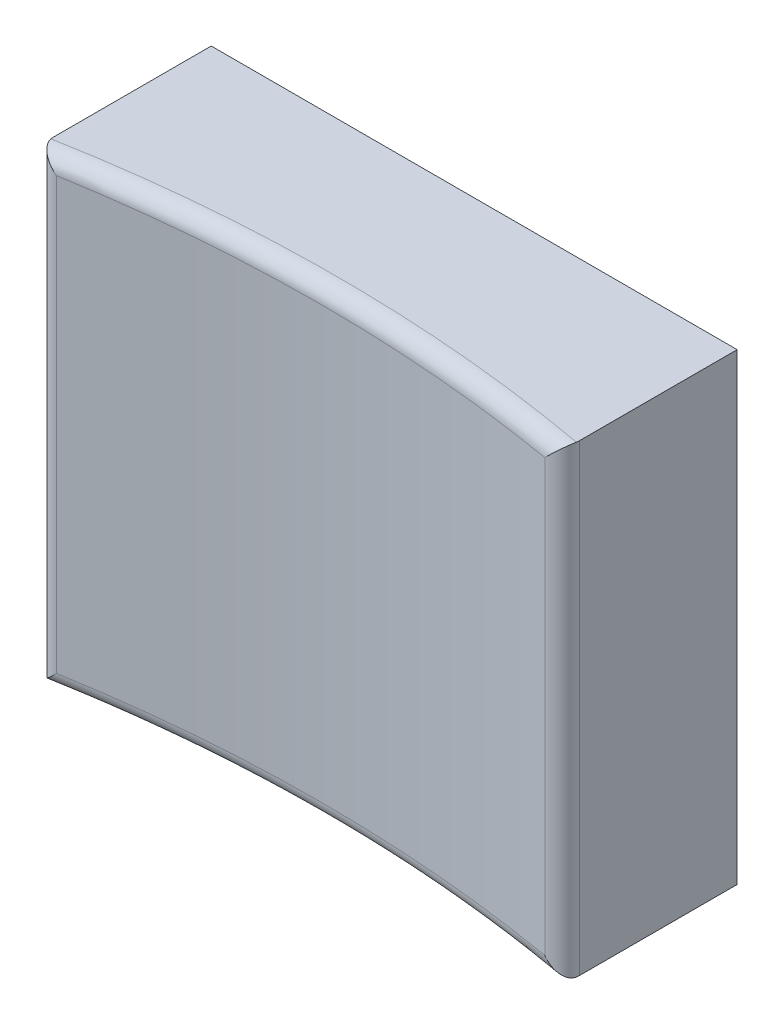
ISO-10303-21;
HEADER;
FILE_DESCRIPTION(('STEP AP214'),'2;1');
FILE_NAME('part.step','',(''),(''),'','','');
FILE_SCHEMA(('AUTOMOTIVE_DESIGN { 1 0 10303 214 1 1 1 1 }'));
ENDSEC;
DATA;
#1=APPLICATION_CONTEXT('core data for automotive mechanical design processes');
#2=APPLICATION_PROTOCOL_DEFINITION('international standard','automotive_design',2000,#1);
#3=PRODUCT_CONTEXT('',#1,'mechanical');
#4=PRODUCT('Part','Part','',(#3));
#5=PRODUCT_RELATED_PRODUCT_CATEGORY('part','',(#4));
#6=PRODUCT_DEFINITION_FORMATION('','',#4);
#7=PRODUCT_DEFINITION_CONTEXT('part definition',#1,'design');
#8=PRODUCT_DEFINITION('design','',#6,#7);
#9=PRODUCT_DEFINITION_SHAPE('','',#8);
#10=(LENGTH_UNIT() NAMED_UNIT(*) SI_UNIT(.MILLI.,.METRE.));
#11=(NAMED_UNIT(*) PLANE_ANGLE_UNIT() SI_UNIT($,.RADIAN.));
#12=(NAMED_UNIT(*) SI_UNIT($,.STERADIAN.) SOLID_ANGLE_UNIT());
#13=UNCERTAINTY_MEASURE_WITH_UNIT(LENGTH_MEASURE(1.E-05),#10,'distance_accuracy_value','');
#14=(GEOMETRIC_REPRESENTATION_CONTEXT(3) GLOBAL_UNCERTAINTY_ASSIGNED_CONTEXT((#13)) GLOBAL_UNIT_ASSIGNED_CONTEXT((#10,
#11,#12)) REPRESENTATION_CONTEXT('',''));
#15=CARTESIAN_POINT('',(0.,0.,0.));
#16=DIRECTION('',(0.,0.,1.));
#17=DIRECTION('',(1.,0.,0.));
#18=AXIS2_PLACEMENT_3D('',#15,#16,#17);
#19=CARTESIAN_POINT('',(-4.1529,3.6576,2.794));
#20=DIRECTION('',(1.,0.,0.));
#21=DIRECTION('',(0.,0.,-1.));
#22=AXIS2_PLACEMENT_3D('',#19,#20,#21);
#23=PLANE('',#22);
#24=DIRECTION('',(0.,0.,-1.));
#25=VECTOR('',#24,1.);
#26=CARTESIAN_POINT('',(-4.1529,-3.6576,2.794));
#27=LINE('',#26,#25);
#28=CARTESIAN_POINT('',(-4.1529,-3.6576,2.49082226780297));
#29=VERTEX_POINT('',#28);
#30=CARTESIAN_POINT('',(-4.1529,-3.6576,0.));
#31=VERTEX_POINT('',#30);
#32=EDGE_CURVE('E100',#29,#31,#27,.T.);
#33=ORIENTED_EDGE('',*,*,#32,.F.);
#34=DIRECTION('',(0.,-1.,0.));
#35=VECTOR('',#34,1.);
#36=CARTESIAN_POINT('',(-4.1529,3.6576,2.49082226780297));
#37=LINE('',#36,#35);
#38=CARTESIAN_POINT('',(-4.1529,3.6576,2.49082226780297));
#39=VERTEX_POINT('',#38);
#40=EDGE_CURVE('E11',#29,#39,#37,.F.);
#41=ORIENTED_EDGE('',*,*,#40,.T.);
#42=DIRECTION('',(0.,0.,-1.));
#43=VECTOR('',#42,1.);
#44=CARTESIAN_POINT('',(-4.1529,3.6576,2.794));
#45=LINE('',#44,#43);
#46=CARTESIAN_POINT('',(-4.1529,3.6576,0.));
#47=VERTEX_POINT('',#46);
#48=EDGE_CURVE('E123',#39,#47,#45,.T.);
#49=ORIENTED_EDGE('',*,*,#48,.T.);
#50=DIRECTION('',(0.,-1.,0.));
#51=VECTOR('',#50,1.);
#52=CARTESIAN_POINT('',(-4.1529,3.6576,0.));
#53=LINE('',#52,#51);
#54=EDGE_CURVE('E119',#47,#31,#53,.T.);
#55=ORIENTED_EDGE('',*,*,#54,.T.);
#56=EDGE_LOOP('',(#33,#41,#49,#55));
#57=FACE_BOUND('',#56,.T.);
#58=ADVANCED_FACE('F31',(#57),#23,.F.);
#59=CARTESIAN_POINT('',(-4.1529,-3.6576,2.794));
#60=DIRECTION('',(0.,1.,0.));
#61=DIRECTION('',(0.,0.,1.));
#62=AXIS2_PLACEMENT_3D('',#59,#60,#61);
#63=PLANE('',#62);
#64=DIRECTION('',(0.,0.,-1.));
#65=VECTOR('',#64,1.);
#66=CARTESIAN_POINT('',(4.1529,-3.6576,2.794));
#67=LINE('',#66,#65);
#68=CARTESIAN_POINT('',(4.1529,-3.6576,2.49082226780297));
#69=VERTEX_POINT('',#68);
#70=CARTESIAN_POINT('',(4.1529,-3.6576,0.));
#71=VERTEX_POINT('',#70);
#72=EDGE_CURVE('E113',#69,#71,#67,.T.);
#73=ORIENTED_EDGE('',*,*,#72,.F.);
#74=CARTESIAN_POINT('',(3.8989,-3.6576,2.49082226780297));
#75=DIRECTION('',(0.,1.,0.));
#76=DIRECTION('',(0.,0.,1.));
#77=AXIS2_PLACEMENT_3D('',#74,#75,#76);
#78=CIRCLE('',#77,0.254);
#79=CARTESIAN_POINT('',(4.14902115128335,-3.6576,2.53504228228519));
#80=VERTEX_POINT('',#79);
#81=EDGE_CURVE('E147',#69,#80,#78,.F.);
#82=ORIENTED_EDGE('',*,*,#81,.T.);
#83=CARTESIAN_POINT('',(0.,-3.6576,25.2736134662053));
#84=DIRECTION('',(0.,1.,0.));
#85=DIRECTION('',(0.,0.,1.));
#86=AXIS2_PLACEMENT_3D('',#83,#84,#85);
#87=CIRCLE('',#86,23.114);
#88=CARTESIAN_POINT('',(-4.14902115128334,-3.6576,2.53504228228519));
#89=VERTEX_POINT('',#88);
#90=EDGE_CURVE('E145',#80,#89,#87,.T.);
#91=ORIENTED_EDGE('',*,*,#90,.T.);
#92=CARTESIAN_POINT('',(-3.8989,-3.6576,2.49082226780297));
#93=DIRECTION('',(0.,1.,0.));
#94=DIRECTION('',(0.,0.,1.));
#95=AXIS2_PLACEMENT_3D('',#92,#93,#94);
#96=CIRCLE('',#95,0.254);
#97=EDGE_CURVE('E108',#89,#29,#96,.F.);
#98=ORIENTED_EDGE('',*,*,#97,.T.);
#99=ORIENTED_EDGE('',*,*,#32,.T.);
#100=DIRECTION('',(1.,0.,0.));
#101=VECTOR('',#100,1.);
#102=CARTESIAN_POINT('',(-4.1529,-3.6576,0.));
#103=LINE('',#102,#101);
#104=EDGE_CURVE('E104',#31,#71,#103,.T.);
#105=ORIENTED_EDGE('',*,*,#104,.T.);
#106=EDGE_LOOP('',(#73,#82,#91,#98,#99,#105));
#107=FACE_BOUND('',#106,.T.);
#108=ADVANCED_FACE('F103',(#107),#63,.F.);
#109=CARTESIAN_POINT('',(4.1529,3.6576,2.794));
#110=DIRECTION('',(-1.,0.,0.));
#111=DIRECTION('',(0.,0.,1.));
#112=AXIS2_PLACEMENT_3D('',#109,#110,#111);
#113=PLANE('',#112);
#114=DIRECTION('',(0.,0.,-1.));
#115=VECTOR('',#114,1.);
#116=CARTESIAN_POINT('',(4.1529,3.6576,2.794));
#117=LINE('',#116,#115);
#118=CARTESIAN_POINT('',(4.1529,3.6576,2.49082226780297));
#119=VERTEX_POINT('',#118);
#120=CARTESIAN_POINT('',(4.1529,3.6576,0.));
#121=VERTEX_POINT('',#120);
#122=EDGE_CURVE('E133',#119,#121,#117,.T.);
#123=ORIENTED_EDGE('',*,*,#122,.F.);
#124=DIRECTION('',(0.,-1.,0.));
#125=VECTOR('',#124,1.);
#126=CARTESIAN_POINT('',(4.1529,3.6576,2.49082226780297));
#127=LINE('',#126,#125);
#128=EDGE_CURVE('E44',#119,#69,#127,.T.);
#129=ORIENTED_EDGE('',*,*,#128,.T.);
#130=ORIENTED_EDGE('',*,*,#72,.T.);
#131=DIRECTION('',(0.,1.,0.));
#132=VECTOR('',#131,1.);
#133=CARTESIAN_POINT('',(4.1529,3.6576,0.));
#134=LINE('',#133,#132);
#135=EDGE_CURVE('E121',#71,#121,#134,.T.);
#136=ORIENTED_EDGE('',*,*,#135,.T.);
#137=EDGE_LOOP('',(#123,#129,#130,#136));
#138=FACE_BOUND('',#137,.T.);
#139=ADVANCED_FACE('F198',(#138),#113,.F.);
#140=CARTESIAN_POINT('',(-4.1529,3.6576,2.794));
#141=DIRECTION('',(0.,-1.,0.));
#142=DIRECTION('',(0.,0.,-1.));
#143=AXIS2_PLACEMENT_3D('',#140,#141,#142);
#144=PLANE('',#143);
#145=CARTESIAN_POINT('',(0.,3.6576,25.2736134662053));
#146=DIRECTION('',(0.,-1.,0.));
#147=DIRECTION('',(0.,0.,-1.));
#148=AXIS2_PLACEMENT_3D('',#145,#146,#147);
#149=CIRCLE('',#148,23.114);
#150=CARTESIAN_POINT('',(-4.14902115128334,3.6576,2.53504228228519));
#151=VERTEX_POINT('',#150);
#152=CARTESIAN_POINT('',(4.14902115128335,3.6576,2.53504228228519));
#153=VERTEX_POINT('',#152);
#154=EDGE_CURVE('E52',#151,#153,#149,.T.);
#155=ORIENTED_EDGE('',*,*,#154,.T.);
#156=CARTESIAN_POINT('',(3.8989,3.6576,2.49082226780297));
#157=DIRECTION('',(0.,-1.,0.));
#158=DIRECTION('',(0.,0.,-1.));
#159=AXIS2_PLACEMENT_3D('',#156,#157,#158);
#160=CIRCLE('',#159,0.254);
#161=EDGE_CURVE('E151',#153,#119,#160,.F.);
#162=ORIENTED_EDGE('',*,*,#161,.T.);
#163=ORIENTED_EDGE('',*,*,#122,.T.);
#164=DIRECTION('',(-1.,0.,0.));
#165=VECTOR('',#164,1.);
#166=CARTESIAN_POINT('',(-4.1529,3.6576,0.));
#167=LINE('',#166,#165);
#168=EDGE_CURVE('E130',#121,#47,#167,.T.);
#169=ORIENTED_EDGE('',*,*,#168,.T.);
#170=ORIENTED_EDGE('',*,*,#48,.F.);
#171=CARTESIAN_POINT('',(-3.8989,3.6576,2.49082226780297));
#172=DIRECTION('',(0.,-1.,0.));
#173=DIRECTION('',(0.,0.,-1.));
#174=AXIS2_PLACEMENT_3D('',#171,#172,#173);
#175=CIRCLE('',#174,0.254);
#176=EDGE_CURVE('E57',#39,#151,#175,.F.);
#177=ORIENTED_EDGE('',*,*,#176,.T.);
#178=EDGE_LOOP('',(#155,#162,#163,#169,#170,#177));
#179=FACE_BOUND('',#178,.T.);
#180=ADVANCED_FACE('F196',(#179),#144,.F.);
#181=CARTESIAN_POINT('',(-4.1529,-3.6576,0.));
#182=DIRECTION('',(0.,0.,1.));
#183=DIRECTION('',(1.,0.,0.));
#184=AXIS2_PLACEMENT_3D('',#181,#182,#183);
#185=PLANE('',#184);
#186=ORIENTED_EDGE('',*,*,#54,.F.);
#187=ORIENTED_EDGE('',*,*,#168,.F.);
#188=ORIENTED_EDGE('',*,*,#135,.F.);
#189=ORIENTED_EDGE('',*,*,#104,.F.);
#190=EDGE_LOOP('',(#186,#187,#188,#189));
#191=FACE_BOUND('',#190,.T.);
#192=ADVANCED_FACE('F117',(#191),#185,.F.);
#193=CARTESIAN_POINT('',(0.,3.6576,25.2736134662053));
#194=DIRECTION('',(0.,-1.,0.));
#195=DIRECTION('',(0.,0.,-1.));
#196=AXIS2_PLACEMENT_3D('',#193,#194,#195);
#197=CYLINDRICAL_SURFACE('',#196,22.86);
#198=DIRECTION('',(0.,-1.,0.));
#199=VECTOR('',#198,1.);
#200=CARTESIAN_POINT('',(-3.85605494505495,3.6576,2.74118261064256));
#201=LINE('',#200,#199);
#202=CARTESIAN_POINT('',(-3.85605494505494,3.4036,2.74118261064256));
#203=VERTEX_POINT('',#202);
#204=CARTESIAN_POINT('',(-3.85605494505494,-3.4036,2.74118261064256));
#205=VERTEX_POINT('',#204);
#206=EDGE_CURVE('E112',#203,#205,#201,.T.);
#207=ORIENTED_EDGE('',*,*,#206,.T.);
#208=CARTESIAN_POINT('',(0.,-3.4036,25.2736134662053));
#209=DIRECTION('',(0.,1.,0.));
#210=DIRECTION('',(0.,0.,1.));
#211=AXIS2_PLACEMENT_3D('',#208,#209,#210);
#212=CIRCLE('',#211,22.86);
#213=CARTESIAN_POINT('',(3.85605494505495,-3.4036,2.74118261064256));
#214=VERTEX_POINT('',#213);
#215=EDGE_CURVE('E141',#205,#214,#212,.F.);
#216=ORIENTED_EDGE('',*,*,#215,.T.);
#217=DIRECTION('',(0.,-1.,0.));
#218=VECTOR('',#217,1.);
#219=CARTESIAN_POINT('',(3.85605494505495,3.6576,2.74118261064256));
#220=LINE('',#219,#218);
#221=CARTESIAN_POINT('',(3.85605494505494,3.4036,2.74118261064256));
#222=VERTEX_POINT('',#221);
#223=EDGE_CURVE('E139',#214,#222,#220,.F.);
#224=ORIENTED_EDGE('',*,*,#223,.T.);
#225=CARTESIAN_POINT('',(0.,3.4036,25.2736134662053));
#226=DIRECTION('',(0.,-1.,0.));
#227=DIRECTION('',(0.,0.,-1.));
#228=AXIS2_PLACEMENT_3D('',#225,#226,#227);
#229=CIRCLE('',#228,22.86);
#230=EDGE_CURVE('E137',#222,#203,#229,.F.);
#231=ORIENTED_EDGE('',*,*,#230,.T.);
#232=EDGE_LOOP('',(#207,#216,#224,#231));
#233=FACE_BOUND('',#232,.T.);
#234=ADVANCED_FACE('F192',(#233),#197,.F.);
#235=CARTESIAN_POINT('',(0.,3.4036,25.2736134662053));
#236=DIRECTION('',(0.,-1.,0.));
#237=DIRECTION('',(0.,0.,-1.));
#238=AXIS2_PLACEMENT_3D('',#235,#236,#237);
#239=TOROIDAL_SURFACE('',#238,23.114,0.254);
#240=CARTESIAN_POINT('',(4.14902115128334,3.6576,2.53504228228519));
#241=CARTESIAN_POINT('',(4.147057413291,3.65761941798704,2.54626051410528));
#242=CARTESIAN_POINT('',(4.14430772511394,3.6568354333532,2.55731081895926));
#243=CARTESIAN_POINT('',(4.13747618648574,3.65382566993983,2.57868277036022));
#244=CARTESIAN_POINT('',(4.13340609550221,3.65161245353686,2.58900990487564));
#245=CARTESIAN_POINT('',(4.12414457602549,3.64591191486797,2.60872099226871));
#246=CARTESIAN_POINT('',(4.11895619634246,3.64242803929229,2.61810740987538));
#247=CARTESIAN_POINT('',(4.10768989632173,3.63439821947881,2.63585133698443));
#248=CARTESIAN_POINT('',(4.10160999846191,3.6298499004188,2.64420648105353));
#249=CARTESIAN_POINT('',(4.08616781818806,3.61787034509634,2.66301192454394));
#250=CARTESIAN_POINT('',(4.07647841036786,3.61002001166474,2.67292620715351));
#251=CARTESIAN_POINT('',(4.05626652321987,3.59311999450385,2.69065535724881));
#252=CARTESIAN_POINT('',(4.04574245787371,3.58406800428347,2.69846609755017));
#253=CARTESIAN_POINT('',(4.01998736240649,3.56142212858062,2.71480621902723));
#254=CARTESIAN_POINT('',(4.00452436143891,3.5474358957305,2.72242320526477));
#255=CARTESIAN_POINT('',(3.9732291866513,3.51849989343228,2.73427998095239));
#256=CARTESIAN_POINT('',(3.95739661035331,3.50354903893871,2.73851589304369));
#257=CARTESIAN_POINT('',(3.92754170272988,3.4748495058296,2.74360271280981));
#258=CARTESIAN_POINT('',(3.91351825281961,3.46115745374889,2.74478377230257));
#259=CARTESIAN_POINT('',(3.88568860791458,3.43359421272603,2.7448588164792));
#260=CARTESIAN_POINT('',(3.87188203426182,3.41972343717708,2.74375737401577));
#261=CARTESIAN_POINT('',(3.85753243966568,3.40510670739394,2.74143209205596));
#262=CARTESIAN_POINT('',(3.8567933938316,3.40435333384913,2.74130897875889));
#263=CARTESIAN_POINT('',(3.85605494505495,3.4036,2.74118261064256));
#264=B_SPLINE_CURVE_WITH_KNOTS('',3,(#240,#241,#242,#243,#244,#245,#246,#247,#248,#249,#250,
#251,#252,#253,#254,#255,#256,#257,#258,#259,#260,#261,#262,#263),.UNSPECIFIED.,.F.,.F.,(4,2,2,
2,2,2,2,2,2,2,2,4),(0.,0.0340672177638823,0.0678390004190167,0.101519849519903,
0.135276570813308,0.182806102249537,0.230428219033018,0.296664129326276,0.362975889149356,
0.421746978486034,0.480400437389645,0.483587928393868),.UNSPECIFIED.);
#265=EDGE_CURVE('E127',#153,#222,#264,.T.);
#266=ORIENTED_EDGE('',*,*,#265,.F.);
#267=ORIENTED_EDGE('',*,*,#154,.F.);
#268=CARTESIAN_POINT('',(-4.14902115128334,3.6576,2.53504228228519));
#269=CARTESIAN_POINT('',(-4.147057413291,3.65761941798704,2.54626051410528));
#270=CARTESIAN_POINT('',(-4.14430772511394,3.6568354333532,2.55731081895926));
#271=CARTESIAN_POINT('',(-4.13747618648574,3.65382566993983,2.57868277036022));
#272=CARTESIAN_POINT('',(-4.13340609550221,3.65161245353686,2.58900990487564));
#273=CARTESIAN_POINT('',(-4.12414457602549,3.64591191486797,2.60872099226871));
#274=CARTESIAN_POINT('',(-4.11895619634246,3.64242803929229,2.61810740987538));
#275=CARTESIAN_POINT('',(-4.10768989632173,3.63439821947881,2.63585133698443));
#276=CARTESIAN_POINT('',(-4.10160999846191,3.6298499004188,2.64420648105353));
#277=CARTESIAN_POINT('',(-4.08616781818806,3.61787034509634,2.66301192454394));
#278=CARTESIAN_POINT('',(-4.07647841036786,3.61002001166474,2.67292620715351));
#279=CARTESIAN_POINT('',(-4.05626652321987,3.59311999450385,2.69065535724881));
#280=CARTESIAN_POINT('',(-4.04574245787371,3.58406800428347,2.69846609755017));
#281=CARTESIAN_POINT('',(-4.01998736240649,3.56142212858062,2.71480621902723));
#282=CARTESIAN_POINT('',(-4.00452436143891,3.5474358957305,2.72242320526477));
#283=CARTESIAN_POINT('',(-3.9732291866513,3.51849989343228,2.73427998095239));
#284=CARTESIAN_POINT('',(-3.95739661035331,3.50354903893871,2.73851589304369));
#285=CARTESIAN_POINT('',(-3.92754170272988,3.4748495058296,2.74360271280981));
#286=CARTESIAN_POINT('',(-3.91351825281961,3.46115745374889,2.74478377230257));
#287=CARTESIAN_POINT('',(-3.88568860791458,3.43359421272603,2.7448588164792));
#288=CARTESIAN_POINT('',(-3.87188203426182,3.41972343717708,2.74375737401577));
#289=CARTESIAN_POINT('',(-3.85753243966568,3.40510670739394,2.74143209205596));
#290=CARTESIAN_POINT('',(-3.8567933938316,3.40435333384913,2.74130897875889));
#291=CARTESIAN_POINT('',(-3.85605494505495,3.4036,2.74118261064256));
#292=B_SPLINE_CURVE_WITH_KNOTS('',3,(#268,#269,#270,#271,#272,#273,#274,#275,#276,#277,#278,
#279,#280,#281,#282,#283,#284,#285,#286,#287,#288,#289,#290,#291),.UNSPECIFIED.,.F.,.F.,(4,2,2,
2,2,2,2,2,2,2,2,4),(0.,0.0340672177638823,0.0678390004190167,0.101519849519903,
0.135276570813308,0.182806102249537,0.230428219033018,0.296664129326276,0.362975889149356,
0.421746978486034,0.480400437389645,0.483587928393868),.UNSPECIFIED.);
#293=EDGE_CURVE('E36',#203,#151,#292,.F.);
#294=ORIENTED_EDGE('',*,*,#293,.F.);
#295=ORIENTED_EDGE('',*,*,#230,.F.);
#296=EDGE_LOOP('',(#266,#267,#294,#295));
#297=FACE_BOUND('',#296,.T.);
#298=ADVANCED_FACE('F33',(#297),#239,.T.);
#299=CARTESIAN_POINT('',(-3.8989,3.6576,2.49082226780297));
#300=DIRECTION('',(0.,-1.,0.));
#301=DIRECTION('',(0.,0.,-1.));
#302=AXIS2_PLACEMENT_3D('',#299,#300,#301);
#303=CYLINDRICAL_SURFACE('',#302,0.254);
#304=ORIENTED_EDGE('',*,*,#40,.F.);
#305=ORIENTED_EDGE('',*,*,#97,.F.);
#306=CARTESIAN_POINT('',(-4.14902115128334,-3.6576,2.53504228228519));
#307=CARTESIAN_POINT('',(-4.147057413291,-3.65761941798704,2.54626051410528));
#308=CARTESIAN_POINT('',(-4.14430772511394,-3.6568354333532,2.55731081895926));
#309=CARTESIAN_POINT('',(-4.13747618648574,-3.65382566993983,2.57868277036022));
#310=CARTESIAN_POINT('',(-4.13340609550221,-3.65161245353686,2.58900990487564));
#311=CARTESIAN_POINT('',(-4.12414457602549,-3.64591191486797,2.60872099226871));
#312=CARTESIAN_POINT('',(-4.11895619634246,-3.64242803929229,2.61810740987538));
#313=CARTESIAN_POINT('',(-4.10768989632173,-3.63439821947881,2.63585133698443));
#314=CARTESIAN_POINT('',(-4.10160999846191,-3.6298499004188,2.64420648105353));
#315=CARTESIAN_POINT('',(-4.08616781818806,-3.61787034509634,2.66301192454394));
#316=CARTESIAN_POINT('',(-4.07647841036786,-3.61002001166474,2.67292620715351));
#317=CARTESIAN_POINT('',(-4.05626652321987,-3.59311999450385,2.69065535724881));
#318=CARTESIAN_POINT('',(-4.04574245787371,-3.58406800428347,2.69846609755017));
#319=CARTESIAN_POINT('',(-4.01998736240649,-3.56142212858062,2.71480621902723));
#320=CARTESIAN_POINT('',(-4.00452436143891,-3.5474358957305,2.72242320526477));
#321=CARTESIAN_POINT('',(-3.9732291866513,-3.51849989343228,2.73427998095239));
#322=CARTESIAN_POINT('',(-3.95739661035331,-3.50354903893871,2.73851589304369));
#323=CARTESIAN_POINT('',(-3.92754170272988,-3.4748495058296,2.74360271280981));
#324=CARTESIAN_POINT('',(-3.91351825281961,-3.46115745374889,2.74478377230257));
#325=CARTESIAN_POINT('',(-3.88568860791458,-3.43359421272603,2.7448588164792));
#326=CARTESIAN_POINT('',(-3.87188203426182,-3.41972343717708,2.74375737401577));
#327=CARTESIAN_POINT('',(-3.85753243966568,-3.40510670739394,2.74143209205596));
#328=CARTESIAN_POINT('',(-3.8567933938316,-3.40435333384913,2.74130897875889));
#329=CARTESIAN_POINT('',(-3.85605494505495,-3.4036,2.74118261064256));
#330=B_SPLINE_CURVE_WITH_KNOTS('',3,(#306,#307,#308,#309,#310,#311,#312,#313,#314,#315,#316,
#317,#318,#319,#320,#321,#322,#323,#324,#325,#326,#327,#328,#329),.UNSPECIFIED.,.F.,.F.,(4,2,2,
2,2,2,2,2,2,2,2,4),(0.,0.0340672177638823,0.0678390004190167,0.101519849519903,
0.135276570813308,0.182806102249537,0.230428219033018,0.296664129326276,0.362975889149356,
0.421746978486034,0.480400437389645,0.483587928393868),.UNSPECIFIED.);
#331=EDGE_CURVE('E161',#205,#89,#330,.F.);
#332=ORIENTED_EDGE('',*,*,#331,.F.);
#333=ORIENTED_EDGE('',*,*,#206,.F.);
#334=ORIENTED_EDGE('',*,*,#293,.T.);
#335=ORIENTED_EDGE('',*,*,#176,.F.);
#336=EDGE_LOOP('',(#304,#305,#332,#333,#334,#335));
#337=FACE_BOUND('',#336,.T.);
#338=ADVANCED_FACE('F171',(#337),#303,.T.);
#339=CARTESIAN_POINT('',(3.8989,3.6576,2.49082226780297));
#340=DIRECTION('',(0.,-1.,0.));
#341=DIRECTION('',(0.,0.,-1.));
#342=AXIS2_PLACEMENT_3D('',#339,#340,#341);
#343=CYLINDRICAL_SURFACE('',#342,0.254);
#344=ORIENTED_EDGE('',*,*,#265,.T.);
#345=ORIENTED_EDGE('',*,*,#223,.F.);
#346=CARTESIAN_POINT('',(4.14902115128334,-3.6576,2.53504228228519));
#347=CARTESIAN_POINT('',(4.147057413291,-3.65761941798704,2.54626051410528));
#348=CARTESIAN_POINT('',(4.14430772511394,-3.6568354333532,2.55731081895926));
#349=CARTESIAN_POINT('',(4.13747618648574,-3.65382566993983,2.57868277036022));
#350=CARTESIAN_POINT('',(4.13340609550221,-3.65161245353686,2.58900990487564));
#351=CARTESIAN_POINT('',(4.12414457602549,-3.64591191486797,2.60872099226871));
#352=CARTESIAN_POINT('',(4.11895619634246,-3.64242803929229,2.61810740987538));
#353=CARTESIAN_POINT('',(4.10768989632173,-3.63439821947881,2.63585133698443));
#354=CARTESIAN_POINT('',(4.10160999846191,-3.6298499004188,2.64420648105353));
#355=CARTESIAN_POINT('',(4.08616781818806,-3.61787034509634,2.66301192454394));
#356=CARTESIAN_POINT('',(4.07647841036786,-3.61002001166474,2.67292620715351));
#357=CARTESIAN_POINT('',(4.05626652321987,-3.59311999450385,2.69065535724881));
#358=CARTESIAN_POINT('',(4.04574245787371,-3.58406800428347,2.69846609755017));
#359=CARTESIAN_POINT('',(4.01998736240649,-3.56142212858062,2.71480621902723));
#360=CARTESIAN_POINT('',(4.00452436143892,-3.54743589573049,2.72242320526477));
#361=CARTESIAN_POINT('',(3.9732291866513,-3.51849989343228,2.73427998095239));
#362=CARTESIAN_POINT('',(3.9573966103533,-3.50354903893872,2.73851589304369));
#363=CARTESIAN_POINT('',(3.92754170272989,-3.47484950582959,2.74360271280981));
#364=CARTESIAN_POINT('',(3.91351825281964,-3.46115745374887,2.74478377230257));
#365=CARTESIAN_POINT('',(3.88568860791457,-3.43359421272604,2.7448588164792));
#366=CARTESIAN_POINT('',(3.87188203426175,-3.41972343717715,2.74375737401576));
#367=CARTESIAN_POINT('',(3.85753243966567,-3.40510670739395,2.74143209205596));
#368=CARTESIAN_POINT('',(3.85679339383159,-3.40435333384913,2.74130897875889));
#369=CARTESIAN_POINT('',(3.85605494505495,-3.4036,2.74118261064256));
#370=B_SPLINE_CURVE_WITH_KNOTS('',3,(#346,#347,#348,#349,#350,#351,#352,#353,#354,#355,#356,
#357,#358,#359,#360,#361,#362,#363,#364,#365,#366,#367,#368,#369),.UNSPECIFIED.,.F.,.F.,(4,2,2,
2,2,2,2,2,2,2,2,4),(0.,0.0340672177638827,0.0678390004190167,0.101519849519903,
0.135276570813308,0.182806102249536,0.230428219033018,0.296664129326277,0.362975889149356,
0.421746978486034,0.480400437389645,0.483587928393868),.UNSPECIFIED.);
#371=EDGE_CURVE('E154',#80,#214,#370,.T.);
#372=ORIENTED_EDGE('',*,*,#371,.F.);
#373=ORIENTED_EDGE('',*,*,#81,.F.);
#374=ORIENTED_EDGE('',*,*,#128,.F.);
#375=ORIENTED_EDGE('',*,*,#161,.F.);
#376=EDGE_LOOP('',(#344,#345,#372,#373,#374,#375));
#377=FACE_BOUND('',#376,.T.);
#378=ADVANCED_FACE('F168',(#377),#343,.T.);
#379=CARTESIAN_POINT('',(0.,-3.4036,25.2736134662053));
#380=DIRECTION('',(0.,1.,0.));
#381=DIRECTION('',(0.,0.,1.));
#382=AXIS2_PLACEMENT_3D('',#379,#380,#381);
#383=TOROIDAL_SURFACE('',#382,23.114,0.254);
#384=ORIENTED_EDGE('',*,*,#331,.T.);
#385=ORIENTED_EDGE('',*,*,#90,.F.);
#386=ORIENTED_EDGE('',*,*,#371,.T.);
#387=ORIENTED_EDGE('',*,*,#215,.F.);
#388=EDGE_LOOP('',(#384,#385,#386,#387));
#389=FACE_BOUND('',#388,.T.);
#390=ADVANCED_FACE('F165',(#389),#383,.T.);
#391=CLOSED_SHELL('',(#58,#108,#139,#180,#192,#234,#298,#338,#378,#390));
#392=MANIFOLD_SOLID_BREP('B2',#391);
#393=ADVANCED_BREP_SHAPE_REPRESENTATION('',(#18,#392),#14);
#394=SHAPE_DEFINITION_REPRESENTATION(#9,#393);
ENDSEC;
END-ISO-10303-21;
